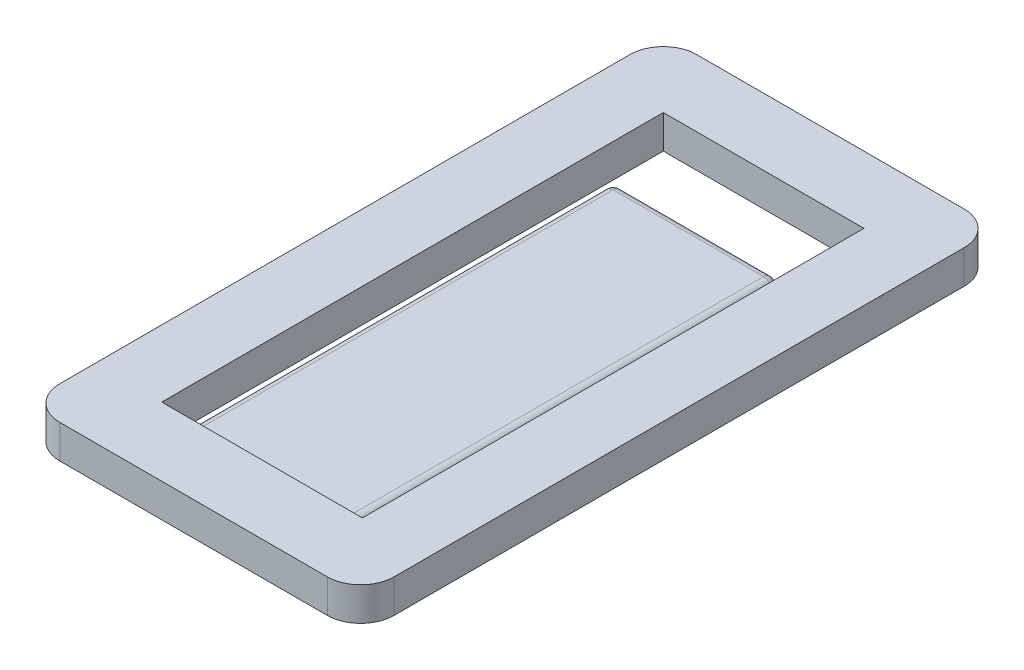
ISO-10303-21;
HEADER;
FILE_DESCRIPTION(('STEP AP214'),'2;1');
FILE_NAME('part.step','',(''),(''),'','','');
FILE_SCHEMA(('AUTOMOTIVE_DESIGN { 1 0 10303 214 1 1 1 1 }'));
ENDSEC;
DATA;
#1=APPLICATION_CONTEXT('core data for automotive mechanical design processes');
#2=APPLICATION_PROTOCOL_DEFINITION('international standard','automotive_design',2000,#1);
#3=PRODUCT_CONTEXT('',#1,'mechanical');
#4=PRODUCT('Part','Part','',(#3));
#5=PRODUCT_RELATED_PRODUCT_CATEGORY('part','',(#4));
#6=PRODUCT_DEFINITION_FORMATION('','',#4);
#7=PRODUCT_DEFINITION_CONTEXT('part definition',#1,'design');
#8=PRODUCT_DEFINITION('design','',#6,#7);
#9=PRODUCT_DEFINITION_SHAPE('','',#8);
#10=(LENGTH_UNIT() NAMED_UNIT(*) SI_UNIT(.MILLI.,.METRE.));
#11=(NAMED_UNIT(*) PLANE_ANGLE_UNIT() SI_UNIT($,.RADIAN.));
#12=(NAMED_UNIT(*) SI_UNIT($,.STERADIAN.) SOLID_ANGLE_UNIT());
#13=UNCERTAINTY_MEASURE_WITH_UNIT(LENGTH_MEASURE(1.E-05),#10,'distance_accuracy_value','');
#14=(GEOMETRIC_REPRESENTATION_CONTEXT(3) GLOBAL_UNCERTAINTY_ASSIGNED_CONTEXT((#13)) GLOBAL_UNIT_ASSIGNED_CONTEXT((#10,
#11,#12)) REPRESENTATION_CONTEXT('',''));
#15=CARTESIAN_POINT('',(0.,0.,0.));
#16=DIRECTION('',(0.,0.,1.));
#17=DIRECTION('',(1.,0.,0.));
#18=AXIS2_PLACEMENT_3D('',#15,#16,#17);
#19=CARTESIAN_POINT('',(-4.,1.,8.525));
#20=DIRECTION('',(0.,1.,0.));
#21=DIRECTION('',(0.,0.,1.));
#22=AXIS2_PLACEMENT_3D('',#19,#20,#21);
#23=CYLINDRICAL_SURFACE('',#22,1.);
#24=DIRECTION('',(0.,1.,0.));
#25=VECTOR('',#24,1.);
#26=CARTESIAN_POINT('',(-5.,1.,8.525));
#27=LINE('',#26,#25);
#28=CARTESIAN_POINT('',(-5.,0.,8.52499999999999));
#29=VERTEX_POINT('',#28);
#30=CARTESIAN_POINT('',(-5.,1.,8.52499999999999));
#31=VERTEX_POINT('',#30);
#32=EDGE_CURVE('E394',#29,#31,#27,.T.);
#33=ORIENTED_EDGE('',*,*,#32,.F.);
#34=CARTESIAN_POINT('',(-4.,0.,8.525));
#35=DIRECTION('',(0.,1.,0.));
#36=DIRECTION('',(0.,0.,1.));
#37=AXIS2_PLACEMENT_3D('',#34,#35,#36);
#38=CIRCLE('',#37,1.);
#39=CARTESIAN_POINT('',(-4.,0.,9.525));
#40=VERTEX_POINT('',#39);
#41=EDGE_CURVE('E47',#40,#29,#38,.F.);
#42=ORIENTED_EDGE('',*,*,#41,.F.);
#43=DIRECTION('',(0.,1.,0.));
#44=VECTOR('',#43,1.);
#45=CARTESIAN_POINT('',(-4.,1.,9.525));
#46=LINE('',#45,#44);
#47=CARTESIAN_POINT('',(-4.,1.,9.525));
#48=VERTEX_POINT('',#47);
#49=EDGE_CURVE('E398',#48,#40,#46,.F.);
#50=ORIENTED_EDGE('',*,*,#49,.F.);
#51=CARTESIAN_POINT('',(-4.,1.,8.525));
#52=DIRECTION('',(0.,1.,0.));
#53=DIRECTION('',(0.,0.,1.));
#54=AXIS2_PLACEMENT_3D('',#51,#52,#53);
#55=CIRCLE('',#54,1.);
#56=EDGE_CURVE('E11',#31,#48,#55,.T.);
#57=ORIENTED_EDGE('',*,*,#56,.F.);
#58=EDGE_LOOP('',(#33,#42,#50,#57));
#59=FACE_BOUND('',#58,.T.);
#60=ADVANCED_FACE('F39',(#59),#23,.T.);
#61=CARTESIAN_POINT('',(4.,1.,8.525));
#62=DIRECTION('',(0.,1.,0.));
#63=DIRECTION('',(0.,0.,1.));
#64=AXIS2_PLACEMENT_3D('',#61,#62,#63);
#65=CYLINDRICAL_SURFACE('',#64,1.);
#66=DIRECTION('',(0.,1.,0.));
#67=VECTOR('',#66,1.);
#68=CARTESIAN_POINT('',(4.,1.,9.525));
#69=LINE('',#68,#67);
#70=CARTESIAN_POINT('',(4.,0.,9.525));
#71=VERTEX_POINT('',#70);
#72=CARTESIAN_POINT('',(4.,1.,9.525));
#73=VERTEX_POINT('',#72);
#74=EDGE_CURVE('E379',#71,#73,#69,.T.);
#75=ORIENTED_EDGE('',*,*,#74,.F.);
#76=CARTESIAN_POINT('',(4.,0.,8.525));
#77=DIRECTION('',(0.,1.,0.));
#78=DIRECTION('',(0.,0.,1.));
#79=AXIS2_PLACEMENT_3D('',#76,#77,#78);
#80=CIRCLE('',#79,1.);
#81=CARTESIAN_POINT('',(5.,0.,8.52499999999999));
#82=VERTEX_POINT('',#81);
#83=EDGE_CURVE('E387',#82,#71,#80,.F.);
#84=ORIENTED_EDGE('',*,*,#83,.F.);
#85=DIRECTION('',(0.,1.,0.));
#86=VECTOR('',#85,1.);
#87=CARTESIAN_POINT('',(5.,1.,8.525));
#88=LINE('',#87,#86);
#89=CARTESIAN_POINT('',(5.,1.,8.52499999999999));
#90=VERTEX_POINT('',#89);
#91=EDGE_CURVE('E383',#90,#82,#88,.F.);
#92=ORIENTED_EDGE('',*,*,#91,.F.);
#93=CARTESIAN_POINT('',(4.,1.,8.525));
#94=DIRECTION('',(0.,1.,0.));
#95=DIRECTION('',(0.,0.,1.));
#96=AXIS2_PLACEMENT_3D('',#93,#94,#95);
#97=CIRCLE('',#96,1.);
#98=EDGE_CURVE('E391',#73,#90,#97,.T.);
#99=ORIENTED_EDGE('',*,*,#98,.F.);
#100=EDGE_LOOP('',(#75,#84,#92,#99));
#101=FACE_BOUND('',#100,.T.);
#102=ADVANCED_FACE('F428',(#101),#65,.T.);
#103=CARTESIAN_POINT('',(4.,1.,-8.525));
#104=DIRECTION('',(0.,-1.,0.));
#105=DIRECTION('',(0.,0.,-1.));
#106=AXIS2_PLACEMENT_3D('',#103,#104,#105);
#107=CYLINDRICAL_SURFACE('',#106,1.);
#108=DIRECTION('',(0.,-1.,0.));
#109=VECTOR('',#108,1.);
#110=CARTESIAN_POINT('',(4.,1.,-9.525));
#111=LINE('',#110,#109);
#112=CARTESIAN_POINT('',(4.,1.,-9.525));
#113=VERTEX_POINT('',#112);
#114=CARTESIAN_POINT('',(4.,0.,-9.525));
#115=VERTEX_POINT('',#114);
#116=EDGE_CURVE('E364',#113,#115,#111,.T.);
#117=ORIENTED_EDGE('',*,*,#116,.F.);
#118=CARTESIAN_POINT('',(4.,1.,-8.525));
#119=DIRECTION('',(0.,1.,0.));
#120=DIRECTION('',(0.,0.,1.));
#121=AXIS2_PLACEMENT_3D('',#118,#119,#120);
#122=CIRCLE('',#121,1.);
#123=CARTESIAN_POINT('',(5.,1.,-8.525));
#124=VERTEX_POINT('',#123);
#125=EDGE_CURVE('E372',#124,#113,#122,.T.);
#126=ORIENTED_EDGE('',*,*,#125,.F.);
#127=DIRECTION('',(0.,-1.,0.));
#128=VECTOR('',#127,1.);
#129=CARTESIAN_POINT('',(5.,1.,-8.525));
#130=LINE('',#129,#128);
#131=CARTESIAN_POINT('',(5.,0.,-8.525));
#132=VERTEX_POINT('',#131);
#133=EDGE_CURVE('E368',#132,#124,#130,.F.);
#134=ORIENTED_EDGE('',*,*,#133,.F.);
#135=CARTESIAN_POINT('',(4.,0.,-8.525));
#136=DIRECTION('',(0.,1.,0.));
#137=DIRECTION('',(0.,0.,1.));
#138=AXIS2_PLACEMENT_3D('',#135,#136,#137);
#139=CIRCLE('',#138,1.);
#140=EDGE_CURVE('E375',#115,#132,#139,.F.);
#141=ORIENTED_EDGE('',*,*,#140,.F.);
#142=EDGE_LOOP('',(#117,#126,#134,#141));
#143=FACE_BOUND('',#142,.T.);
#144=ADVANCED_FACE('F420',(#143),#107,.T.);
#145=CARTESIAN_POINT('',(-4.,1.,-8.525));
#146=DIRECTION('',(0.,-1.,0.));
#147=DIRECTION('',(0.,0.,-1.));
#148=AXIS2_PLACEMENT_3D('',#145,#146,#147);
#149=CYLINDRICAL_SURFACE('',#148,1.);
#150=DIRECTION('',(0.,-1.,0.));
#151=VECTOR('',#150,1.);
#152=CARTESIAN_POINT('',(-5.,1.,-8.525));
#153=LINE('',#152,#151);
#154=CARTESIAN_POINT('',(-5.,1.,-8.525));
#155=VERTEX_POINT('',#154);
#156=CARTESIAN_POINT('',(-5.,0.,-8.525));
#157=VERTEX_POINT('',#156);
#158=EDGE_CURVE('E349',#155,#157,#153,.T.);
#159=ORIENTED_EDGE('',*,*,#158,.F.);
#160=CARTESIAN_POINT('',(-4.,1.,-8.525));
#161=DIRECTION('',(0.,1.,0.));
#162=DIRECTION('',(0.,0.,1.));
#163=AXIS2_PLACEMENT_3D('',#160,#161,#162);
#164=CIRCLE('',#163,1.);
#165=CARTESIAN_POINT('',(-4.,1.,-9.525));
#166=VERTEX_POINT('',#165);
#167=EDGE_CURVE('E357',#166,#155,#164,.T.);
#168=ORIENTED_EDGE('',*,*,#167,.F.);
#169=DIRECTION('',(0.,-1.,0.));
#170=VECTOR('',#169,1.);
#171=CARTESIAN_POINT('',(-4.,1.,-9.525));
#172=LINE('',#171,#170);
#173=CARTESIAN_POINT('',(-4.,0.,-9.525));
#174=VERTEX_POINT('',#173);
#175=EDGE_CURVE('E353',#174,#166,#172,.F.);
#176=ORIENTED_EDGE('',*,*,#175,.F.);
#177=CARTESIAN_POINT('',(-4.,0.,-8.525));
#178=DIRECTION('',(0.,1.,0.));
#179=DIRECTION('',(0.,0.,1.));
#180=AXIS2_PLACEMENT_3D('',#177,#178,#179);
#181=CIRCLE('',#180,1.);
#182=EDGE_CURVE('E360',#157,#174,#181,.F.);
#183=ORIENTED_EDGE('',*,*,#182,.F.);
#184=EDGE_LOOP('',(#159,#168,#176,#183));
#185=FACE_BOUND('',#184,.T.);
#186=ADVANCED_FACE('F409',(#185),#149,.T.);
#187=CARTESIAN_POINT('',(2.25,0.25,-5.275));
#188=DIRECTION('',(-1.,0.,0.));
#189=DIRECTION('',(0.,0.,1.));
#190=AXIS2_PLACEMENT_3D('',#187,#188,#189);
#191=SPHERICAL_SURFACE('',#190,0.25);
#192=CARTESIAN_POINT('',(2.25,0.25,-5.275));
#193=DIRECTION('',(0.,-1.,0.));
#194=DIRECTION('',(0.,0.,-1.));
#195=AXIS2_PLACEMENT_3D('',#192,#193,#194);
#196=CIRCLE('',#195,0.25);
#197=CARTESIAN_POINT('',(2.25,0.25,-5.525));
#198=VERTEX_POINT('',#197);
#199=CARTESIAN_POINT('',(2.5,0.25,-5.275));
#200=VERTEX_POINT('',#199);
#201=EDGE_CURVE('E346',#198,#200,#196,.T.);
#202=ORIENTED_EDGE('',*,*,#201,.F.);
#203=CARTESIAN_POINT('',(2.25,0.25,-5.275));
#204=DIRECTION('',(1.,0.,0.));
#205=DIRECTION('',(0.,0.,-1.));
#206=AXIS2_PLACEMENT_3D('',#203,#204,#205);
#207=CIRCLE('',#206,0.25);
#208=CARTESIAN_POINT('',(2.25,0.5,-5.275));
#209=VERTEX_POINT('',#208);
#210=EDGE_CURVE('E329',#209,#198,#207,.F.);
#211=ORIENTED_EDGE('',*,*,#210,.F.);
#212=CARTESIAN_POINT('',(2.25,0.25,-5.275));
#213=DIRECTION('',(0.,0.,-1.));
#214=DIRECTION('',(-1.,0.,0.));
#215=AXIS2_PLACEMENT_3D('',#212,#213,#214);
#216=CIRCLE('',#215,0.25);
#217=EDGE_CURVE('E342',#209,#200,#216,.T.);
#218=ORIENTED_EDGE('',*,*,#217,.T.);
#219=EDGE_LOOP('',(#202,#211,#218));
#220=FACE_BOUND('',#219,.T.);
#221=ADVANCED_FACE('F456',(#220),#191,.T.);
#222=CARTESIAN_POINT('',(2.25,0.25,0.));
#223=DIRECTION('',(0.,0.,1.));
#224=DIRECTION('',(1.,0.,0.));
#225=AXIS2_PLACEMENT_3D('',#222,#223,#224);
#226=CYLINDRICAL_SURFACE('',#225,0.25);
#227=ORIENTED_EDGE('',*,*,#217,.F.);
#228=DIRECTION('',(0.,0.,-1.));
#229=VECTOR('',#228,1.);
#230=CARTESIAN_POINT('',(2.25,0.5,0.));
#231=LINE('',#230,#229);
#232=CARTESIAN_POINT('',(2.25,0.5,7.475));
#233=VERTEX_POINT('',#232);
#234=EDGE_CURVE('E320',#233,#209,#231,.T.);
#235=ORIENTED_EDGE('',*,*,#234,.F.);
#236=CARTESIAN_POINT('',(2.25,0.25,7.475));
#237=DIRECTION('',(0.,0.,1.));
#238=DIRECTION('',(1.,0.,0.));
#239=AXIS2_PLACEMENT_3D('',#236,#237,#238);
#240=CIRCLE('',#239,0.25);
#241=CARTESIAN_POINT('',(2.5,0.25,7.475));
#242=VERTEX_POINT('',#241);
#243=EDGE_CURVE('E339',#233,#242,#240,.F.);
#244=ORIENTED_EDGE('',*,*,#243,.T.);
#245=DIRECTION('',(0.,0.,-1.));
#246=VECTOR('',#245,1.);
#247=CARTESIAN_POINT('',(2.5,0.25,0.));
#248=LINE('',#247,#246);
#249=EDGE_CURVE('E193',#200,#242,#248,.F.);
#250=ORIENTED_EDGE('',*,*,#249,.F.);
#251=EDGE_LOOP('',(#227,#235,#244,#250));
#252=FACE_BOUND('',#251,.T.);
#253=ADVANCED_FACE('F461',(#252),#226,.T.);
#254=CARTESIAN_POINT('',(2.25,0.,-5.275));
#255=DIRECTION('',(0.,-1.,0.));
#256=DIRECTION('',(0.,0.,-1.));
#257=AXIS2_PLACEMENT_3D('',#254,#255,#256);
#258=CYLINDRICAL_SURFACE('',#257,0.25);
#259=DIRECTION('',(0.,-1.,0.));
#260=VECTOR('',#259,1.);
#261=CARTESIAN_POINT('',(2.25,0.,-5.525));
#262=LINE('',#261,#260);
#263=CARTESIAN_POINT('',(2.25,0.,-5.525));
#264=VERTEX_POINT('',#263);
#265=EDGE_CURVE('E333',#198,#264,#262,.T.);
#266=ORIENTED_EDGE('',*,*,#265,.F.);
#267=ORIENTED_EDGE('',*,*,#201,.T.);
#268=DIRECTION('',(0.,-1.,0.));
#269=VECTOR('',#268,1.);
#270=CARTESIAN_POINT('',(2.5,0.,-5.275));
#271=LINE('',#270,#269);
#272=CARTESIAN_POINT('',(2.5,0.,-5.275));
#273=VERTEX_POINT('',#272);
#274=EDGE_CURVE('E324',#273,#200,#271,.F.);
#275=ORIENTED_EDGE('',*,*,#274,.F.);
#276=CARTESIAN_POINT('',(2.25,0.,-5.275));
#277=DIRECTION('',(0.,1.,0.));
#278=DIRECTION('',(0.,0.,1.));
#279=AXIS2_PLACEMENT_3D('',#276,#277,#278);
#280=CIRCLE('',#279,0.25);
#281=EDGE_CURVE('E181',#264,#273,#280,.F.);
#282=ORIENTED_EDGE('',*,*,#281,.F.);
#283=EDGE_LOOP('',(#266,#267,#275,#282));
#284=FACE_BOUND('',#283,.T.);
#285=ADVANCED_FACE('F457',(#284),#258,.T.);
#286=CARTESIAN_POINT('',(-2.25,0.25,-5.275));
#287=DIRECTION('',(1.,0.,0.));
#288=DIRECTION('',(0.,0.,-1.));
#289=AXIS2_PLACEMENT_3D('',#286,#287,#288);
#290=SPHERICAL_SURFACE('',#289,0.25);
#291=CARTESIAN_POINT('',(-2.25,0.25,-5.275));
#292=DIRECTION('',(0.,0.,1.));
#293=DIRECTION('',(1.,0.,0.));
#294=AXIS2_PLACEMENT_3D('',#291,#292,#293);
#295=CIRCLE('',#294,0.25);
#296=CARTESIAN_POINT('',(-2.25,0.5,-5.275));
#297=VERTEX_POINT('',#296);
#298=CARTESIAN_POINT('',(-2.5,0.25,-5.275));
#299=VERTEX_POINT('',#298);
#300=EDGE_CURVE('E314',#297,#299,#295,.T.);
#301=ORIENTED_EDGE('',*,*,#300,.F.);
#302=CARTESIAN_POINT('',(-2.25,0.25,-5.275));
#303=DIRECTION('',(1.,0.,0.));
#304=DIRECTION('',(0.,0.,-1.));
#305=AXIS2_PLACEMENT_3D('',#302,#303,#304);
#306=CIRCLE('',#305,0.25);
#307=CARTESIAN_POINT('',(-2.25,0.25,-5.525));
#308=VERTEX_POINT('',#307);
#309=EDGE_CURVE('E302',#308,#297,#306,.T.);
#310=ORIENTED_EDGE('',*,*,#309,.F.);
#311=CARTESIAN_POINT('',(-2.25,0.25,-5.275));
#312=DIRECTION('',(0.,1.,0.));
#313=DIRECTION('',(0.,0.,1.));
#314=AXIS2_PLACEMENT_3D('',#311,#312,#313);
#315=CIRCLE('',#314,0.25);
#316=EDGE_CURVE('E310',#308,#299,#315,.T.);
#317=ORIENTED_EDGE('',*,*,#316,.T.);
#318=EDGE_LOOP('',(#301,#310,#317));
#319=FACE_BOUND('',#318,.T.);
#320=ADVANCED_FACE('F460',(#319),#290,.T.);
#321=CARTESIAN_POINT('',(-2.25,0.,-5.275));
#322=DIRECTION('',(0.,1.,0.));
#323=DIRECTION('',(0.,0.,1.));
#324=AXIS2_PLACEMENT_3D('',#321,#322,#323);
#325=CYLINDRICAL_SURFACE('',#324,0.25);
#326=ORIENTED_EDGE('',*,*,#316,.F.);
#327=DIRECTION('',(0.,1.,0.));
#328=VECTOR('',#327,1.);
#329=CARTESIAN_POINT('',(-2.25,0.,-5.525));
#330=LINE('',#329,#328);
#331=CARTESIAN_POINT('',(-2.25,0.,-5.525));
#332=VERTEX_POINT('',#331);
#333=EDGE_CURVE('E287',#332,#308,#330,.T.);
#334=ORIENTED_EDGE('',*,*,#333,.F.);
#335=CARTESIAN_POINT('',(-2.25,0.,-5.275));
#336=DIRECTION('',(0.,1.,0.));
#337=DIRECTION('',(0.,0.,1.));
#338=AXIS2_PLACEMENT_3D('',#335,#336,#337);
#339=CIRCLE('',#338,0.25);
#340=CARTESIAN_POINT('',(-2.5,0.,-5.275));
#341=VERTEX_POINT('',#340);
#342=EDGE_CURVE('E299',#341,#332,#339,.F.);
#343=ORIENTED_EDGE('',*,*,#342,.F.);
#344=DIRECTION('',(0.,1.,0.));
#345=VECTOR('',#344,1.);
#346=CARTESIAN_POINT('',(-2.5,0.,-5.275));
#347=LINE('',#346,#345);
#348=EDGE_CURVE('E295',#299,#341,#347,.F.);
#349=ORIENTED_EDGE('',*,*,#348,.F.);
#350=EDGE_LOOP('',(#326,#334,#343,#349));
#351=FACE_BOUND('',#350,.T.);
#352=ADVANCED_FACE('F473',(#351),#325,.T.);
#353=CARTESIAN_POINT('',(-2.25,0.25,0.));
#354=DIRECTION('',(0.,0.,-1.));
#355=DIRECTION('',(-1.,0.,0.));
#356=AXIS2_PLACEMENT_3D('',#353,#354,#355);
#357=CYLINDRICAL_SURFACE('',#356,0.25);
#358=DIRECTION('',(0.,0.,1.));
#359=VECTOR('',#358,1.);
#360=CARTESIAN_POINT('',(-2.25,0.5,0.));
#361=LINE('',#360,#359);
#362=CARTESIAN_POINT('',(-2.25,0.5,7.475));
#363=VERTEX_POINT('',#362);
#364=EDGE_CURVE('E306',#297,#363,#361,.T.);
#365=ORIENTED_EDGE('',*,*,#364,.F.);
#366=ORIENTED_EDGE('',*,*,#300,.T.);
#367=DIRECTION('',(0.,0.,1.));
#368=VECTOR('',#367,1.);
#369=CARTESIAN_POINT('',(-2.5,0.25,0.));
#370=LINE('',#369,#368);
#371=CARTESIAN_POINT('',(-2.5,0.25,7.475));
#372=VERTEX_POINT('',#371);
#373=EDGE_CURVE('E291',#372,#299,#370,.F.);
#374=ORIENTED_EDGE('',*,*,#373,.F.);
#375=CARTESIAN_POINT('',(-2.25,0.25,7.475));
#376=DIRECTION('',(0.,0.,1.));
#377=DIRECTION('',(1.,0.,0.));
#378=AXIS2_PLACEMENT_3D('',#375,#376,#377);
#379=CIRCLE('',#378,0.25);
#380=EDGE_CURVE('E317',#372,#363,#379,.F.);
#381=ORIENTED_EDGE('',*,*,#380,.T.);
#382=EDGE_LOOP('',(#365,#366,#374,#381));
#383=FACE_BOUND('',#382,.T.);
#384=ADVANCED_FACE('F469',(#383),#357,.T.);
#385=CARTESIAN_POINT('',(0.,0.25,-5.275));
#386=DIRECTION('',(1.,0.,0.));
#387=DIRECTION('',(0.,0.,-1.));
#388=AXIS2_PLACEMENT_3D('',#385,#386,#387);
#389=CYLINDRICAL_SURFACE('',#388,0.25);
#390=DIRECTION('',(-1.,0.,0.));
#391=VECTOR('',#390,1.);
#392=CARTESIAN_POINT('',(0.,0.5,-5.275));
#393=LINE('',#392,#391);
#394=EDGE_CURVE('E269',#209,#297,#393,.T.);
#395=ORIENTED_EDGE('',*,*,#394,.F.);
#396=ORIENTED_EDGE('',*,*,#210,.T.);
#397=DIRECTION('',(-1.,0.,0.));
#398=VECTOR('',#397,1.);
#399=CARTESIAN_POINT('',(0.,0.25,-5.525));
#400=LINE('',#399,#398);
#401=EDGE_CURVE('E283',#308,#198,#400,.F.);
#402=ORIENTED_EDGE('',*,*,#401,.F.);
#403=ORIENTED_EDGE('',*,*,#309,.T.);
#404=EDGE_LOOP('',(#395,#396,#402,#403));
#405=FACE_BOUND('',#404,.T.);
#406=ADVANCED_FACE('F472',(#405),#389,.T.);
#407=CARTESIAN_POINT('',(-2.5,0.,7.475));
#408=DIRECTION('',(1.,0.,0.));
#409=DIRECTION('',(0.,0.,-1.));
#410=AXIS2_PLACEMENT_3D('',#407,#408,#409);
#411=PLANE('',#410);
#412=ORIENTED_EDGE('',*,*,#373,.T.);
#413=ORIENTED_EDGE('',*,*,#348,.T.);
#414=DIRECTION('',(0.,0.,-1.));
#415=VECTOR('',#414,1.);
#416=CARTESIAN_POINT('',(-2.5,0.,7.475));
#417=LINE('',#416,#415);
#418=CARTESIAN_POINT('',(-2.5,0.,7.475));
#419=VERTEX_POINT('',#418);
#420=EDGE_CURVE('E226',#419,#341,#417,.T.);
#421=ORIENTED_EDGE('',*,*,#420,.F.);
#422=DIRECTION('',(0.,1.,0.));
#423=VECTOR('',#422,1.);
#424=CARTESIAN_POINT('',(-2.5,0.,7.475));
#425=LINE('',#424,#423);
#426=EDGE_CURVE('E240',#419,#372,#425,.T.);
#427=ORIENTED_EDGE('',*,*,#426,.T.);
#428=EDGE_LOOP('',(#412,#413,#421,#427));
#429=FACE_BOUND('',#428,.T.);
#430=ADVANCED_FACE('F483',(#429),#411,.F.);
#431=CARTESIAN_POINT('',(2.5,0.,7.475));
#432=DIRECTION('',(-1.,0.,0.));
#433=DIRECTION('',(0.,0.,1.));
#434=AXIS2_PLACEMENT_3D('',#431,#432,#433);
#435=PLANE('',#434);
#436=ORIENTED_EDGE('',*,*,#274,.T.);
#437=ORIENTED_EDGE('',*,*,#249,.T.);
#438=DIRECTION('',(0.,1.,0.));
#439=VECTOR('',#438,1.);
#440=CARTESIAN_POINT('',(2.5,0.,7.475));
#441=LINE('',#440,#439);
#442=CARTESIAN_POINT('',(2.5,0.,7.475));
#443=VERTEX_POINT('',#442);
#444=EDGE_CURVE('E190',#443,#242,#441,.T.);
#445=ORIENTED_EDGE('',*,*,#444,.F.);
#446=DIRECTION('',(0.,0.,1.));
#447=VECTOR('',#446,1.);
#448=CARTESIAN_POINT('',(2.5,0.,7.475));
#449=LINE('',#448,#447);
#450=EDGE_CURVE('E173',#273,#443,#449,.T.);
#451=ORIENTED_EDGE('',*,*,#450,.F.);
#452=EDGE_LOOP('',(#436,#437,#445,#451));
#453=FACE_BOUND('',#452,.T.);
#454=ADVANCED_FACE('F191',(#453),#435,.F.);
#455=CARTESIAN_POINT('',(-2.5,0.,-5.525));
#456=DIRECTION('',(0.,0.,1.));
#457=DIRECTION('',(1.,0.,0.));
#458=AXIS2_PLACEMENT_3D('',#455,#456,#457);
#459=PLANE('',#458);
#460=ORIENTED_EDGE('',*,*,#401,.T.);
#461=ORIENTED_EDGE('',*,*,#265,.T.);
#462=DIRECTION('',(1.,0.,0.));
#463=VECTOR('',#462,1.);
#464=CARTESIAN_POINT('',(-2.5,0.,-5.525));
#465=LINE('',#464,#463);
#466=EDGE_CURVE('E211',#332,#264,#465,.T.);
#467=ORIENTED_EDGE('',*,*,#466,.F.);
#468=ORIENTED_EDGE('',*,*,#333,.T.);
#469=EDGE_LOOP('',(#460,#461,#467,#468));
#470=FACE_BOUND('',#469,.T.);
#471=ADVANCED_FACE('F487',(#470),#459,.F.);
#472=CARTESIAN_POINT('',(5.,1.,-9.525));
#473=DIRECTION('',(-1.,0.,0.));
#474=DIRECTION('',(0.,0.,1.));
#475=AXIS2_PLACEMENT_3D('',#472,#473,#474);
#476=PLANE('',#475);
#477=DIRECTION('',(0.,0.,-1.));
#478=VECTOR('',#477,1.);
#479=CARTESIAN_POINT('',(5.,1.,-9.525));
#480=LINE('',#479,#478);
#481=EDGE_CURVE('E256',#90,#124,#480,.T.);
#482=ORIENTED_EDGE('',*,*,#481,.F.);
#483=ORIENTED_EDGE('',*,*,#91,.T.);
#484=DIRECTION('',(0.,0.,-1.));
#485=VECTOR('',#484,1.);
#486=CARTESIAN_POINT('',(5.,0.,-9.525));
#487=LINE('',#486,#485);
#488=EDGE_CURVE('E255',#82,#132,#487,.T.);
#489=ORIENTED_EDGE('',*,*,#488,.T.);
#490=ORIENTED_EDGE('',*,*,#133,.T.);
#491=EDGE_LOOP('',(#482,#483,#489,#490));
#492=FACE_BOUND('',#491,.T.);
#493=ADVANCED_FACE('F423',(#492),#476,.F.);
#494=CARTESIAN_POINT('',(-5.,1.,-9.525));
#495=DIRECTION('',(0.,0.,1.));
#496=DIRECTION('',(1.,0.,0.));
#497=AXIS2_PLACEMENT_3D('',#494,#495,#496);
#498=PLANE('',#497);
#499=DIRECTION('',(-1.,0.,0.));
#500=VECTOR('',#499,1.);
#501=CARTESIAN_POINT('',(-5.,1.,-9.525));
#502=LINE('',#501,#500);
#503=EDGE_CURVE('E259',#113,#166,#502,.T.);
#504=ORIENTED_EDGE('',*,*,#503,.F.);
#505=ORIENTED_EDGE('',*,*,#116,.T.);
#506=DIRECTION('',(-1.,0.,0.));
#507=VECTOR('',#506,1.);
#508=CARTESIAN_POINT('',(-5.,0.,-9.525));
#509=LINE('',#508,#507);
#510=EDGE_CURVE('E272',#115,#174,#509,.T.);
#511=ORIENTED_EDGE('',*,*,#510,.T.);
#512=ORIENTED_EDGE('',*,*,#175,.T.);
#513=EDGE_LOOP('',(#504,#505,#511,#512));
#514=FACE_BOUND('',#513,.T.);
#515=ADVANCED_FACE('F416',(#514),#498,.F.);
#516=CARTESIAN_POINT('',(-5.,1.,-9.525));
#517=DIRECTION('',(1.,0.,0.));
#518=DIRECTION('',(0.,0.,-1.));
#519=AXIS2_PLACEMENT_3D('',#516,#517,#518);
#520=PLANE('',#519);
#521=DIRECTION('',(0.,0.,1.));
#522=VECTOR('',#521,1.);
#523=CARTESIAN_POINT('',(-5.,0.,-9.525));
#524=LINE('',#523,#522);
#525=EDGE_CURVE('E275',#157,#29,#524,.T.);
#526=ORIENTED_EDGE('',*,*,#525,.T.);
#527=ORIENTED_EDGE('',*,*,#32,.T.);
#528=DIRECTION('',(0.,0.,1.));
#529=VECTOR('',#528,1.);
#530=CARTESIAN_POINT('',(-5.,1.,-9.525));
#531=LINE('',#530,#529);
#532=EDGE_CURVE('E263',#155,#31,#531,.T.);
#533=ORIENTED_EDGE('',*,*,#532,.F.);
#534=ORIENTED_EDGE('',*,*,#158,.T.);
#535=EDGE_LOOP('',(#526,#527,#533,#534));
#536=FACE_BOUND('',#535,.T.);
#537=ADVANCED_FACE('F405',(#536),#520,.F.);
#538=CARTESIAN_POINT('',(-5.,1.,9.525));
#539=DIRECTION('',(0.,0.,-1.));
#540=DIRECTION('',(-1.,0.,0.));
#541=AXIS2_PLACEMENT_3D('',#538,#539,#540);
#542=PLANE('',#541);
#543=DIRECTION('',(1.,0.,0.));
#544=VECTOR('',#543,1.);
#545=CARTESIAN_POINT('',(-5.,1.,9.525));
#546=LINE('',#545,#544);
#547=EDGE_CURVE('E266',#48,#73,#546,.T.);
#548=ORIENTED_EDGE('',*,*,#547,.F.);
#549=ORIENTED_EDGE('',*,*,#49,.T.);
#550=DIRECTION('',(1.,0.,0.));
#551=VECTOR('',#550,1.);
#552=CARTESIAN_POINT('',(-5.,0.,9.525));
#553=LINE('',#552,#551);
#554=EDGE_CURVE('E260',#40,#71,#553,.T.);
#555=ORIENTED_EDGE('',*,*,#554,.T.);
#556=ORIENTED_EDGE('',*,*,#74,.T.);
#557=EDGE_LOOP('',(#548,#549,#555,#556));
#558=FACE_BOUND('',#557,.T.);
#559=ADVANCED_FACE('F431',(#558),#542,.F.);
#560=CARTESIAN_POINT('',(0.,1.,0.));
#561=DIRECTION('',(0.,1.,0.));
#562=DIRECTION('',(0.,0.,1.));
#563=AXIS2_PLACEMENT_3D('',#560,#561,#562);
#564=PLANE('',#563);
#565=DIRECTION('',(0.,0.,-1.));
#566=VECTOR('',#565,1.);
#567=CARTESIAN_POINT('',(3.,1.,7.475));
#568=LINE('',#567,#566);
#569=CARTESIAN_POINT('',(3.,1.,7.475));
#570=VERTEX_POINT('',#569);
#571=CARTESIAN_POINT('',(3.,1.,-7.525));
#572=VERTEX_POINT('',#571);
#573=EDGE_CURVE('E186',#570,#572,#568,.T.);
#574=ORIENTED_EDGE('',*,*,#573,.F.);
#575=DIRECTION('',(1.,0.,0.));
#576=VECTOR('',#575,1.);
#577=CARTESIAN_POINT('',(0.,1.,7.475));
#578=LINE('',#577,#576);
#579=CARTESIAN_POINT('',(-3.,1.,7.475));
#580=VERTEX_POINT('',#579);
#581=EDGE_CURVE('E239',#580,#570,#578,.T.);
#582=ORIENTED_EDGE('',*,*,#581,.F.);
#583=DIRECTION('',(0.,0.,1.));
#584=VECTOR('',#583,1.);
#585=CARTESIAN_POINT('',(-3.,1.,0.));
#586=LINE('',#585,#584);
#587=CARTESIAN_POINT('',(-3.,1.,-7.525));
#588=VERTEX_POINT('',#587);
#589=EDGE_CURVE('E251',#588,#580,#586,.T.);
#590=ORIENTED_EDGE('',*,*,#589,.F.);
#591=DIRECTION('',(-1.,0.,0.));
#592=VECTOR('',#591,1.);
#593=CARTESIAN_POINT('',(0.,1.,-7.525));
#594=LINE('',#593,#592);
#595=EDGE_CURVE('E248',#572,#588,#594,.T.);
#596=ORIENTED_EDGE('',*,*,#595,.F.);
#597=EDGE_LOOP('',(#574,#582,#590,#596));
#598=FACE_BOUND('',#597,.T.);
#599=ORIENTED_EDGE('',*,*,#532,.T.);
#600=ORIENTED_EDGE('',*,*,#56,.T.);
#601=ORIENTED_EDGE('',*,*,#547,.T.);
#602=ORIENTED_EDGE('',*,*,#98,.T.);
#603=ORIENTED_EDGE('',*,*,#481,.T.);
#604=ORIENTED_EDGE('',*,*,#125,.T.);
#605=ORIENTED_EDGE('',*,*,#503,.T.);
#606=ORIENTED_EDGE('',*,*,#167,.T.);
#607=EDGE_LOOP('',(#599,#600,#601,#602,#603,#604,#605,#606));
#608=FACE_BOUND('',#607,.T.);
#609=ADVANCED_FACE('F432',(#598,#608),#564,.T.);
#610=CARTESIAN_POINT('',(0.,0.,0.));
#611=DIRECTION('',(0.,1.,0.));
#612=DIRECTION('',(0.,0.,1.));
#613=AXIS2_PLACEMENT_3D('',#610,#611,#612);
#614=PLANE('',#613);
#615=ORIENTED_EDGE('',*,*,#466,.T.);
#616=ORIENTED_EDGE('',*,*,#281,.T.);
#617=ORIENTED_EDGE('',*,*,#450,.T.);
#618=DIRECTION('',(1.,0.,0.));
#619=VECTOR('',#618,1.);
#620=CARTESIAN_POINT('',(2.5,0.,7.475));
#621=LINE('',#620,#619);
#622=CARTESIAN_POINT('',(3.,0.,7.475));
#623=VERTEX_POINT('',#622);
#624=EDGE_CURVE('E180',#443,#623,#621,.T.);
#625=ORIENTED_EDGE('',*,*,#624,.T.);
#626=DIRECTION('',(0.,0.,-1.));
#627=VECTOR('',#626,1.);
#628=CARTESIAN_POINT('',(3.,0.,7.475));
#629=LINE('',#628,#627);
#630=CARTESIAN_POINT('',(3.,0.,-7.525));
#631=VERTEX_POINT('',#630);
#632=EDGE_CURVE('E197',#623,#631,#629,.T.);
#633=ORIENTED_EDGE('',*,*,#632,.T.);
#634=DIRECTION('',(-1.,0.,0.));
#635=VECTOR('',#634,1.);
#636=CARTESIAN_POINT('',(-3.,0.,-7.525));
#637=LINE('',#636,#635);
#638=CARTESIAN_POINT('',(-3.,0.,-7.525));
#639=VERTEX_POINT('',#638);
#640=EDGE_CURVE('E230',#631,#639,#637,.T.);
#641=ORIENTED_EDGE('',*,*,#640,.T.);
#642=DIRECTION('',(0.,0.,1.));
#643=VECTOR('',#642,1.);
#644=CARTESIAN_POINT('',(-3.,0.,7.475));
#645=LINE('',#644,#643);
#646=CARTESIAN_POINT('',(-3.,0.,7.475));
#647=VERTEX_POINT('',#646);
#648=EDGE_CURVE('E216',#639,#647,#645,.T.);
#649=ORIENTED_EDGE('',*,*,#648,.T.);
#650=DIRECTION('',(1.,0.,0.));
#651=VECTOR('',#650,1.);
#652=CARTESIAN_POINT('',(-3.,0.,7.475));
#653=LINE('',#652,#651);
#654=EDGE_CURVE('E222',#647,#419,#653,.T.);
#655=ORIENTED_EDGE('',*,*,#654,.T.);
#656=ORIENTED_EDGE('',*,*,#420,.T.);
#657=ORIENTED_EDGE('',*,*,#342,.T.);
#658=EDGE_LOOP('',(#615,#616,#617,#625,#633,#641,#649,#655,#656,#657));
#659=FACE_BOUND('',#658,.T.);
#660=ORIENTED_EDGE('',*,*,#554,.F.);
#661=ORIENTED_EDGE('',*,*,#41,.T.);
#662=ORIENTED_EDGE('',*,*,#525,.F.);
#663=ORIENTED_EDGE('',*,*,#182,.T.);
#664=ORIENTED_EDGE('',*,*,#510,.F.);
#665=ORIENTED_EDGE('',*,*,#140,.T.);
#666=ORIENTED_EDGE('',*,*,#488,.F.);
#667=ORIENTED_EDGE('',*,*,#83,.T.);
#668=EDGE_LOOP('',(#660,#661,#662,#663,#664,#665,#666,#667));
#669=FACE_BOUND('',#668,.T.);
#670=ADVANCED_FACE('F176',(#659,#669),#614,.F.);
#671=CARTESIAN_POINT('',(-3.,0.,7.475));
#672=DIRECTION('',(-1.,0.,0.));
#673=DIRECTION('',(0.,0.,1.));
#674=AXIS2_PLACEMENT_3D('',#671,#672,#673);
#675=PLANE('',#674);
#676=ORIENTED_EDGE('',*,*,#589,.T.);
#677=DIRECTION('',(0.,1.,0.));
#678=VECTOR('',#677,1.);
#679=CARTESIAN_POINT('',(-3.,0.,7.475));
#680=LINE('',#679,#678);
#681=EDGE_CURVE('E234',#647,#580,#680,.T.);
#682=ORIENTED_EDGE('',*,*,#681,.F.);
#683=ORIENTED_EDGE('',*,*,#648,.F.);
#684=DIRECTION('',(0.,1.,0.));
#685=VECTOR('',#684,1.);
#686=CARTESIAN_POINT('',(-3.,0.,-7.525));
#687=LINE('',#686,#685);
#688=EDGE_CURVE('E235',#639,#588,#687,.T.);
#689=ORIENTED_EDGE('',*,*,#688,.T.);
#690=EDGE_LOOP('',(#676,#682,#683,#689));
#691=FACE_BOUND('',#690,.T.);
#692=ADVANCED_FACE('F440',(#691),#675,.F.);
#693=CARTESIAN_POINT('',(-3.,0.,-7.525));
#694=DIRECTION('',(0.,0.,-1.));
#695=DIRECTION('',(-1.,0.,0.));
#696=AXIS2_PLACEMENT_3D('',#693,#694,#695);
#697=PLANE('',#696);
#698=ORIENTED_EDGE('',*,*,#595,.T.);
#699=ORIENTED_EDGE('',*,*,#688,.F.);
#700=ORIENTED_EDGE('',*,*,#640,.F.);
#701=DIRECTION('',(0.,1.,0.));
#702=VECTOR('',#701,1.);
#703=CARTESIAN_POINT('',(3.,0.,-7.525));
#704=LINE('',#703,#702);
#705=EDGE_CURVE('E212',#631,#572,#704,.T.);
#706=ORIENTED_EDGE('',*,*,#705,.T.);
#707=EDGE_LOOP('',(#698,#699,#700,#706));
#708=FACE_BOUND('',#707,.T.);
#709=ADVANCED_FACE('F518',(#708),#697,.F.);
#710=CARTESIAN_POINT('',(-3.,0.,7.475));
#711=DIRECTION('',(0.,0.,1.));
#712=DIRECTION('',(1.,0.,0.));
#713=AXIS2_PLACEMENT_3D('',#710,#711,#712);
#714=PLANE('',#713);
#715=ORIENTED_EDGE('',*,*,#581,.T.);
#716=DIRECTION('',(0.,1.,0.));
#717=VECTOR('',#716,1.);
#718=CARTESIAN_POINT('',(3.,0.,7.475));
#719=LINE('',#718,#717);
#720=EDGE_CURVE('E196',#623,#570,#719,.T.);
#721=ORIENTED_EDGE('',*,*,#720,.F.);
#722=ORIENTED_EDGE('',*,*,#624,.F.);
#723=ORIENTED_EDGE('',*,*,#444,.T.);
#724=ORIENTED_EDGE('',*,*,#243,.F.);
#725=DIRECTION('',(1.,0.,0.));
#726=VECTOR('',#725,1.);
#727=CARTESIAN_POINT('',(-2.5,0.5,7.475));
#728=LINE('',#727,#726);
#729=EDGE_CURVE('E680',#363,#233,#728,.T.);
#730=ORIENTED_EDGE('',*,*,#729,.F.);
#731=ORIENTED_EDGE('',*,*,#380,.F.);
#732=ORIENTED_EDGE('',*,*,#426,.F.);
#733=ORIENTED_EDGE('',*,*,#654,.F.);
#734=ORIENTED_EDGE('',*,*,#681,.T.);
#735=EDGE_LOOP('',(#715,#721,#722,#723,#724,#730,#731,#732,#733,#734));
#736=FACE_BOUND('',#735,.T.);
#737=ADVANCED_FACE('F200',(#736),#714,.F.);
#738=CARTESIAN_POINT('',(3.,0.,7.475));
#739=DIRECTION('',(1.,0.,0.));
#740=DIRECTION('',(0.,0.,-1.));
#741=AXIS2_PLACEMENT_3D('',#738,#739,#740);
#742=PLANE('',#741);
#743=ORIENTED_EDGE('',*,*,#573,.T.);
#744=ORIENTED_EDGE('',*,*,#705,.F.);
#745=ORIENTED_EDGE('',*,*,#632,.F.);
#746=ORIENTED_EDGE('',*,*,#720,.T.);
#747=EDGE_LOOP('',(#743,#744,#745,#746));
#748=FACE_BOUND('',#747,.T.);
#749=ADVANCED_FACE('F533',(#748),#742,.F.);
#750=CARTESIAN_POINT('',(0.,0.5,0.));
#751=DIRECTION('',(0.,1.,0.));
#752=DIRECTION('',(0.,0.,1.));
#753=AXIS2_PLACEMENT_3D('',#750,#751,#752);
#754=PLANE('',#753);
#755=ORIENTED_EDGE('',*,*,#729,.T.);
#756=ORIENTED_EDGE('',*,*,#234,.T.);
#757=ORIENTED_EDGE('',*,*,#394,.T.);
#758=ORIENTED_EDGE('',*,*,#364,.T.);
#759=EDGE_LOOP('',(#755,#756,#757,#758));
#760=FACE_BOUND('',#759,.T.);
#761=ADVANCED_FACE('F541',(#760),#754,.T.);
#762=CLOSED_SHELL('',(#60,#102,#144,#186,#221,#253,#285,#320,#352,#384,#406,#430,#454,#471,#493,
#515,#537,#559,#609,#670,#692,#709,#737,#749,#761));
#763=MANIFOLD_SOLID_BREP('B2',#762);
#764=ADVANCED_BREP_SHAPE_REPRESENTATION('',(#18,#763),#14);
#765=SHAPE_DEFINITION_REPRESENTATION(#9,#764);
ENDSEC;
END-ISO-10303-21;
